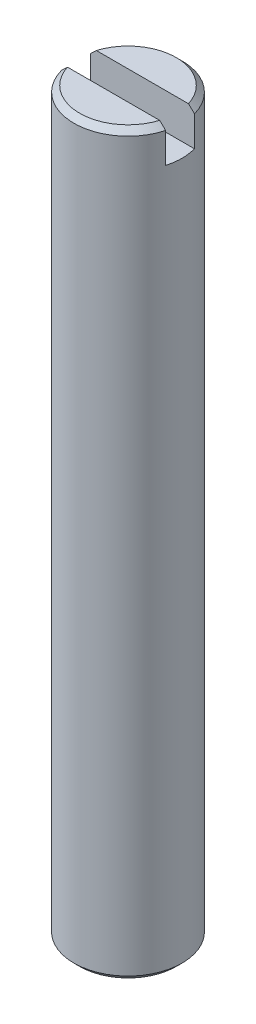
ISO-10303-21;
HEADER;
FILE_DESCRIPTION(('STEP AP214'),'2;1');
FILE_NAME('part.step','',(''),(''),'','','');
FILE_SCHEMA(('AUTOMOTIVE_DESIGN { 1 0 10303 214 1 1 1 1 }'));
ENDSEC;
DATA;
#1=APPLICATION_CONTEXT('core data for automotive mechanical design processes');
#2=APPLICATION_PROTOCOL_DEFINITION('international standard','automotive_design',2000,#1);
#3=PRODUCT_CONTEXT('',#1,'mechanical');
#4=PRODUCT('Part','Part','',(#3));
#5=PRODUCT_RELATED_PRODUCT_CATEGORY('part','',(#4));
#6=PRODUCT_DEFINITION_FORMATION('','',#4);
#7=PRODUCT_DEFINITION_CONTEXT('part definition',#1,'design');
#8=PRODUCT_DEFINITION('design','',#6,#7);
#9=PRODUCT_DEFINITION_SHAPE('','',#8);
#10=(LENGTH_UNIT() NAMED_UNIT(*) SI_UNIT(.MILLI.,.METRE.));
#11=(NAMED_UNIT(*) PLANE_ANGLE_UNIT() SI_UNIT($,.RADIAN.));
#12=(NAMED_UNIT(*) SI_UNIT($,.STERADIAN.) SOLID_ANGLE_UNIT());
#13=UNCERTAINTY_MEASURE_WITH_UNIT(LENGTH_MEASURE(1.E-05),#10,'distance_accuracy_value','');
#14=(GEOMETRIC_REPRESENTATION_CONTEXT(3) GLOBAL_UNCERTAINTY_ASSIGNED_CONTEXT((#13)) GLOBAL_UNIT_ASSIGNED_CONTEXT((#10,
#11,#12)) REPRESENTATION_CONTEXT('',''));
#15=CARTESIAN_POINT('',(0.,0.,0.));
#16=DIRECTION('',(0.,0.,1.));
#17=DIRECTION('',(1.,0.,0.));
#18=AXIS2_PLACEMENT_3D('',#15,#16,#17);
#19=CARTESIAN_POINT('',(0.,65.1002,0.));
#20=DIRECTION('',(0.,-1.,0.));
#21=DIRECTION('',(0.,0.,-0.999999999999981));
#22=AXIS2_PLACEMENT_3D('',#19,#20,#21);
#23=CYLINDRICAL_SURFACE('',#22,4.7625);
#24=CARTESIAN_POINT('',(0.,0.508000000000008,0.));
#25=DIRECTION('',(0.,1.,0.));
#26=DIRECTION('',(0.,0.,0.999999999999981));
#27=AXIS2_PLACEMENT_3D('',#24,#25,#26);
#28=CIRCLE('',#27,4.7625);
#29=CARTESIAN_POINT('',(0.,0.508000000000003,4.76249999999992));
#30=VERTEX_POINT('',#29);
#31=EDGE_CURVE('E163',#30,#30,#28,.T.);
#32=ORIENTED_EDGE('',*,*,#31,.T.);
#33=EDGE_LOOP('',(#32));
#34=FACE_BOUND('',#33,.T.);
#35=DIRECTION('',(0.,1.,0.));
#36=VECTOR('',#35,1.);
#37=CARTESIAN_POINT('',(4.59004950733374,61.9252000000007,-1.26998101175738));
#38=LINE('',#37,#36);
#39=CARTESIAN_POINT('',(4.59004950733374,61.9252000000007,-1.26998101175738));
#40=VERTEX_POINT('',#39);
#41=CARTESIAN_POINT('',(4.59004950733381,64.5922000000007,-1.26998101175736));
#42=VERTEX_POINT('',#41);
#43=EDGE_CURVE('E85',#40,#42,#38,.T.);
#44=ORIENTED_EDGE('',*,*,#43,.F.);
#45=CARTESIAN_POINT('',(-2.63677968348475E-13,61.9252000000004,1.38777878078145E-13));
#46=DIRECTION('',(0.,1.,0.));
#47=DIRECTION('',(0.,0.,0.999999999999981));
#48=AXIS2_PLACEMENT_3D('',#45,#46,#47);
#49=CIRCLE('',#48,4.7625);
#50=CARTESIAN_POINT('',(4.59003899978012,61.9252000000007,1.27001898824262));
#51=VERTEX_POINT('',#50);
#52=EDGE_CURVE('E124',#51,#40,#49,.T.);
#53=ORIENTED_EDGE('',*,*,#52,.F.);
#54=DIRECTION('',(0.,1.,0.));
#55=VECTOR('',#54,1.);
#56=CARTESIAN_POINT('',(4.59003899978012,61.9252000000007,1.27001898824262));
#57=LINE('',#56,#55);
#58=CARTESIAN_POINT('',(4.59003899978015,64.5922000000007,1.27001898824262));
#59=VERTEX_POINT('',#58);
#60=EDGE_CURVE('E154',#51,#59,#57,.T.);
#61=ORIENTED_EDGE('',*,*,#60,.T.);
#62=CARTESIAN_POINT('',(0.,64.5922,0.));
#63=DIRECTION('',(0.,1.,0.));
#64=DIRECTION('',(0.,0.,0.999999999999981));
#65=AXIS2_PLACEMENT_3D('',#62,#63,#64);
#66=CIRCLE('',#65,4.7625);
#67=CARTESIAN_POINT('',(-4.59003899978025,64.5922,1.27001898824262));
#68=VERTEX_POINT('',#67);
#69=EDGE_CURVE('E153',#59,#68,#66,.F.);
#70=ORIENTED_EDGE('',*,*,#69,.T.);
#71=DIRECTION('',(0.,1.,0.));
#72=VECTOR('',#71,1.);
#73=CARTESIAN_POINT('',(-4.59003899978025,61.9252,1.27001898824262));
#74=LINE('',#73,#72);
#75=CARTESIAN_POINT('',(-4.59003899978025,61.9252,1.27001898824262));
#76=VERTEX_POINT('',#75);
#77=EDGE_CURVE('E123',#76,#68,#74,.T.);
#78=ORIENTED_EDGE('',*,*,#77,.F.);
#79=CARTESIAN_POINT('',(-2.63677968348475E-13,61.9252000000004,1.38777878078145E-13));
#80=DIRECTION('',(0.,1.,0.));
#81=DIRECTION('',(0.,0.,0.999999999999981));
#82=AXIS2_PLACEMENT_3D('',#79,#80,#81);
#83=CIRCLE('',#82,4.7625);
#84=CARTESIAN_POINT('',(-4.59004950733394,61.9252,-1.26998101175735));
#85=VERTEX_POINT('',#84);
#86=EDGE_CURVE('E130',#85,#76,#83,.T.);
#87=ORIENTED_EDGE('',*,*,#86,.F.);
#88=DIRECTION('',(0.,1.,0.));
#89=VECTOR('',#88,1.);
#90=CARTESIAN_POINT('',(-4.59004950733394,61.9252,-1.26998101175735));
#91=LINE('',#90,#89);
#92=CARTESIAN_POINT('',(-4.59004950733387,64.5922,-1.26998101175736));
#93=VERTEX_POINT('',#92);
#94=EDGE_CURVE('E113',#85,#93,#91,.T.);
#95=ORIENTED_EDGE('',*,*,#94,.T.);
#96=EDGE_CURVE('E162',#93,#42,#66,.F.);
#97=ORIENTED_EDGE('',*,*,#96,.T.);
#98=EDGE_LOOP('',(#44,#53,#61,#70,#78,#87,#95,#97));
#99=FACE_BOUND('',#98,.T.);
#100=ADVANCED_FACE('F54',(#34,#99),#23,.T.);
#101=CARTESIAN_POINT('',(0.,65.1002,0.));
#102=DIRECTION('',(0.,1.,0.));
#103=DIRECTION('',(0.,0.,0.999999999999981));
#104=AXIS2_PLACEMENT_3D('',#101,#102,#103);
#105=PLANE('',#104);
#106=CARTESIAN_POINT('',(0.,65.1002,0.));
#107=DIRECTION('',(0.,1.,0.));
#108=DIRECTION('',(0.,0.,0.999999999999981));
#109=AXIS2_PLACEMENT_3D('',#106,#107,#108);
#110=CIRCLE('',#109,4.25450000000001);
#111=CARTESIAN_POINT('',(4.06053179765584,65.1002000000007,-1.26998101175729));
#112=VERTEX_POINT('',#111);
#113=CARTESIAN_POINT('',(-4.06053179765604,65.1002,-1.26998101175738));
#114=VERTEX_POINT('',#113);
#115=EDGE_CURVE('E174',#112,#114,#110,.T.);
#116=ORIENTED_EDGE('',*,*,#115,.T.);
#117=DIRECTION('',(0.999999999999984,0.,0.));
#118=VECTOR('',#117,1.);
#119=CARTESIAN_POINT('',(0.,65.1002,-1.26998101175732));
#120=LINE('',#119,#118);
#121=EDGE_CURVE('E145',#114,#112,#120,.T.);
#122=ORIENTED_EDGE('',*,*,#121,.T.);
#123=EDGE_LOOP('',(#116,#122));
#124=FACE_BOUND('',#123,.T.);
#125=ADVANCED_FACE('F196',(#124),#105,.T.);
#126=CARTESIAN_POINT('',(0.,65.1002,0.));
#127=DIRECTION('',(0.,-1.,0.));
#128=DIRECTION('',(0.,0.,-0.999999999999981));
#129=AXIS2_PLACEMENT_3D('',#126,#127,#128);
#130=CONICAL_SURFACE('',#129,4.25450000000001,0.785398163397447);
#131=ORIENTED_EDGE('',*,*,#96,.F.);
#132=CARTESIAN_POINT('',(-4.59074950733394,64.5915253433965,-1.26998101175736));
#133=CARTESIAN_POINT('',(-4.49426275570938,64.6845163030769,-1.26998101175731));
#134=CARTESIAN_POINT('',(-4.39767496238978,64.7774026086035,-1.26998101175729));
#135=CARTESIAN_POINT('',(-4.20424670417685,64.962913634492,-1.26998101175728));
#136=CARTESIAN_POINT('',(-4.10740623679045,65.0555383522538,-1.26998101175728));
#137=CARTESIAN_POINT('',(-3.81636135916374,65.3330070632296,-1.26998101175729));
#138=CARTESIAN_POINT('',(-3.62170447919837,65.517377031967,-1.26998101175729));
#139=CARTESIAN_POINT('',(-3.23385271365689,65.8810673162497,-1.26998101175728));
#140=CARTESIAN_POINT('',(-3.0406886465293,66.0604203291235,-1.26998101175728));
#141=CARTESIAN_POINT('',(-2.74874204893649,66.3270120387675,-1.26998101175729));
#142=CARTESIAN_POINT('',(-2.65106751309825,66.4154627993676,-1.26998101175729));
#143=CARTESIAN_POINT('',(-2.45472844235903,66.5912571798075,-1.26998101175728));
#144=CARTESIAN_POINT('',(-2.35606393247958,66.6786008275039,-1.26998101175726));
#145=CARTESIAN_POINT('',(-2.18558356670794,66.8271684177092,-1.26998101175727));
#146=CARTESIAN_POINT('',(-2.11409633993677,66.8887689772846,-1.26998101175728));
#147=CARTESIAN_POINT('',(-1.97023146497192,67.0109386523525,-1.2699810117573));
#148=CARTESIAN_POINT('',(-1.89785373001643,67.0715076659491,-1.2699810117573));
#149=CARTESIAN_POINT('',(-1.75124585860368,67.1918452507448,-1.26998101175728));
#150=CARTESIAN_POINT('',(-1.67700453882124,67.2516002471075,-1.26998101175727));
#151=CARTESIAN_POINT('',(-1.52700509754219,67.3691465721649,-1.26998101175731));
#152=CARTESIAN_POINT('',(-1.45124736932053,67.4269383997769,-1.26998101175736));
#153=CARTESIAN_POINT('',(-1.29660057146003,67.5405269941732,-1.26998101175736));
#154=CARTESIAN_POINT('',(-1.2176825590367,67.5962846720251,-1.26998101175731));
#155=CARTESIAN_POINT('',(-1.0568329975531,67.7035951186852,-1.26998101175727));
#156=CARTESIAN_POINT('',(-0.974897496831777,67.7551420669048,-1.2699810117573));
#157=CARTESIAN_POINT('',(-0.808051933647524,67.8509829353184,-1.26998101175729));
#158=CARTESIAN_POINT('',(-0.723186008936165,67.8953523119665,-1.26998101175726));
#159=CARTESIAN_POINT('',(-0.548714807410018,67.9734248014219,-1.26998101175733));
#160=CARTESIAN_POINT('',(-0.459126204350625,68.007162844366,-1.26998101175743));
#161=CARTESIAN_POINT('',(-0.324917691979478,68.0444440580088,-1.26998101175736));
#162=CARTESIAN_POINT('',(-0.282098758259119,68.0544592501056,-1.26998101175731));
#163=CARTESIAN_POINT('',(-0.195697393467257,68.0704299175541,-1.26998101175727));
#164=CARTESIAN_POINT('',(-0.152115050118602,68.0763858562532,-1.26998101175729));
#165=CARTESIAN_POINT('',(-0.0647426939826841,68.0838114605327,-1.2699810117573));
#166=CARTESIAN_POINT('',(-0.0209542627054029,68.08529939965,-1.2699810117573));
#167=CARTESIAN_POINT('',(0.0665421596847269,68.0837294980874,-1.26998101175729));
#168=CARTESIAN_POINT('',(0.110250145968702,68.0806713928947,-1.26998101175729));
#169=CARTESIAN_POINT('',(0.196822341365673,68.0702719382411,-1.26998101175729));
#170=CARTESIAN_POINT('',(0.239690363574121,68.0629616620645,-1.26998101175729));
#171=CARTESIAN_POINT('',(0.32460713407298,68.0445469596036,-1.2699810117573));
#172=CARTESIAN_POINT('',(0.366655539388717,68.0334409795395,-1.2699810117573));
#173=CARTESIAN_POINT('',(0.45001897542273,68.0079327360431,-1.26998101175729));
#174=CARTESIAN_POINT('',(0.491327637359782,67.9935099483332,-1.26998101175728));
#175=CARTESIAN_POINT('',(0.572888863071271,67.9619903012736,-1.26998101175731));
#176=CARTESIAN_POINT('',(0.61314162336338,67.9448939436945,-1.26998101175736));
#177=CARTESIAN_POINT('',(0.728288887841829,67.8922556541554,-1.26998101175741));
#178=CARTESIAN_POINT('',(0.801899264997753,67.853914178528,-1.26998101175733));
#179=CARTESIAN_POINT('',(0.946227515108531,67.7720860231769,-1.26998101175727));
#180=CARTESIAN_POINT('',(1.01694189197514,67.7285933577535,-1.26998101175729));
#181=CARTESIAN_POINT('',(1.15635730274571,67.6379580862929,-1.26998101175731));
#182=CARTESIAN_POINT('',(1.22504958681348,67.5908021371157,-1.2699810117573));
#183=CARTESIAN_POINT('',(1.36064282747446,67.4940686056052,-1.2699810117573));
#184=CARTESIAN_POINT('',(1.42754459779617,67.4444921532688,-1.2699810117573));
#185=CARTESIAN_POINT('',(1.5608390760659,67.3429384694286,-1.2699810117573));
#186=CARTESIAN_POINT('',(1.62721459021712,67.2909387762693,-1.2699810117573));
#187=CARTESIAN_POINT('',(1.75889415089429,67.1855970057394,-1.2699810117573));
#188=CARTESIAN_POINT('',(1.8241981278087,67.1322548417223,-1.2699810117573));
#189=CARTESIAN_POINT('',(2.01855524523048,66.9709736529516,-1.2699810117573));
#190=CARTESIAN_POINT('',(2.14636437889695,66.8615378462329,-1.26998101175731));
#191=CARTESIAN_POINT('',(2.37451403941741,66.6623463589025,-1.26998101175731));
#192=CARTESIAN_POINT('',(2.47524009909021,66.5730278303459,-1.26998101175731));
#193=CARTESIAN_POINT('',(2.67567950488401,66.39325630394,-1.2699810117573));
#194=CARTESIAN_POINT('',(2.77539282434622,66.3028032763662,-1.2699810117573));
#195=CARTESIAN_POINT('',(3.0735865197818,66.0300544952168,-1.26998101175731));
#196=CARTESIAN_POINT('',(3.27093990444587,65.8465289583345,-1.26998101175731));
#197=CARTESIAN_POINT('',(3.65602924308663,65.4849109229384,-1.26998101175731));
#198=CARTESIAN_POINT('',(3.8438354054998,65.3068928254433,-1.26998101175731));
#199=CARTESIAN_POINT('',(4.1246114882073,65.039090062743,-1.26998101175731));
#200=CARTESIAN_POINT('',(4.2179978835399,64.949741593544,-1.26998101175731));
#201=CARTESIAN_POINT('',(4.40453737700997,64.770803006567,-1.26998101175731));
#202=CARTESIAN_POINT('',(4.49769047713895,64.6812128908655,-1.2699810117573));
#203=CARTESIAN_POINT('',(4.59074950733379,64.5915253433972,-1.26998101175729));
#204=B_SPLINE_CURVE_WITH_KNOTS('',3,(#132,#133,#134,#135,#136,#137,#138,#139,#140,#141,#142,
#143,#144,#145,#146,#147,#148,#149,#150,#151,#152,#153,#154,#155,#156,#157,#158,#159,#160,#161,
#162,#163,#164,#165,#166,#167,#168,#169,#170,#171,#172,#173,#174,#175,#176,#177,#178,#179,#180,
#181,#182,#183,#184,#185,#186,#187,#188,#189,#190,#191,#192,#193,#194,#195,#196,#197,#198,#199,
#200,#201,#202,#203),.UNSPECIFIED.,.F.,.F.,(4,2,2,2,2,2,2,2,2,2,2,2,2,2,2,2,2,2,2,2,2,2,2,2,2,2,
2,2,2,2,2,2,2,2,2,4),(0.,0.402011401713599,0.804026785108336,1.60835370186284,2.39909846986459,
2.79440885596589,3.18970927566334,3.47280178927791,3.75592210639236,4.04180465812567,
4.32761400402758,4.61741129342275,4.90760262616238,5.19451101810427,5.48046667506966,
5.61222725798859,5.74397279844561,5.87517877786248,6.00639239183212,6.13665898169748,
6.26697896047333,6.39812815217902,6.52925275952069,6.77789148363919,7.02682201495168,
7.27670608957075,7.52647460246064,7.77940817061136,8.03235810584316,8.53707669958208,
8.94094077858872,9.34481546127225,10.1532886747437,10.929591338277,11.3173247422461,
11.705054825),.UNSPECIFIED.);
#205=EDGE_CURVE('E13',#93,#114,#204,.T.);
#206=ORIENTED_EDGE('',*,*,#205,.T.);
#207=ORIENTED_EDGE('',*,*,#115,.F.);
#208=EDGE_CURVE('E60',#112,#42,#204,.T.);
#209=ORIENTED_EDGE('',*,*,#208,.T.);
#210=EDGE_LOOP('',(#131,#206,#207,#209));
#211=FACE_BOUND('',#210,.T.);
#212=ADVANCED_FACE('F194',(#211),#130,.T.);
#213=DIRECTION('',(0.999999999999983,0.,0.));
#214=VECTOR('',#213,1.);
#215=CARTESIAN_POINT('',(0.,65.1002,1.27001898824267));
#216=LINE('',#215,#214);
#217=CARTESIAN_POINT('',(-4.06051991985058,65.1002,1.27001898824262));
#218=VERTEX_POINT('',#217);
#219=CARTESIAN_POINT('',(4.06051991985053,65.1002000000007,1.27001898824262));
#220=VERTEX_POINT('',#219);
#221=EDGE_CURVE('E77',#218,#220,#216,.T.);
#222=ORIENTED_EDGE('',*,*,#221,.F.);
#223=EDGE_CURVE('E171',#218,#220,#110,.T.);
#224=ORIENTED_EDGE('',*,*,#223,.T.);
#225=EDGE_LOOP('',(#222,#224));
#226=FACE_BOUND('',#225,.T.);
#227=ADVANCED_FACE('F190',(#226),#105,.T.);
#228=CARTESIAN_POINT('',(0.,0.,0.));
#229=DIRECTION('',(0.,1.,0.));
#230=DIRECTION('',(0.,0.,0.999999999999981));
#231=AXIS2_PLACEMENT_3D('',#228,#229,#230);
#232=PLANE('',#231);
#233=CARTESIAN_POINT('',(0.,0.,0.));
#234=DIRECTION('',(0.,1.,0.));
#235=DIRECTION('',(0.,0.,0.999999999999981));
#236=AXIS2_PLACEMENT_3D('',#233,#234,#235);
#237=CIRCLE('',#236,4.2545);
#238=CARTESIAN_POINT('',(0.,0.,4.25449999999992));
#239=VERTEX_POINT('',#238);
#240=EDGE_CURVE('E167',#239,#239,#237,.F.);
#241=ORIENTED_EDGE('',*,*,#240,.T.);
#242=EDGE_LOOP('',(#241));
#243=FACE_BOUND('',#242,.T.);
#244=ADVANCED_FACE('F193',(#243),#232,.F.);
#245=CARTESIAN_POINT('',(0.,0.508000000000008,0.));
#246=DIRECTION('',(0.,1.,0.));
#247=DIRECTION('',(0.,0.,0.999999999999981));
#248=AXIS2_PLACEMENT_3D('',#245,#246,#247);
#249=CONICAL_SURFACE('',#248,4.7625,0.78539816339744);
#250=ORIENTED_EDGE('',*,*,#240,.F.);
#251=EDGE_LOOP('',(#250));
#252=FACE_BOUND('',#251,.T.);
#253=ORIENTED_EDGE('',*,*,#31,.F.);
#254=EDGE_LOOP('',(#253));
#255=FACE_BOUND('',#254,.T.);
#256=ADVANCED_FACE('F199',(#252,#255),#249,.T.);
#257=CARTESIAN_POINT('',(-4.59073899978027,64.5915253449406,1.27001898824269));
#258=CARTESIAN_POINT('',(-4.49425668428542,64.6845118167069,1.27001898824271));
#259=CARTESIAN_POINT('',(-4.39767333001825,64.7773936370717,1.27001898824272));
#260=CARTESIAN_POINT('',(-4.20425396055334,64.9628957027796,1.27001898824272));
#261=CARTESIAN_POINT('',(-4.10741794286295,65.0555159455231,1.27001898824272));
#262=CARTESIAN_POINT('',(-3.81638645235925,65.3329712392876,1.27001898824272));
#263=CARTESIAN_POINT('',(-3.62173853257117,65.5173322886024,1.27001898824272));
#264=CARTESIAN_POINT('',(-3.23390437611167,65.8810052954539,1.27001898824271));
#265=CARTESIAN_POINT('',(-3.04074895293064,66.0603499451458,1.27001898824269));
#266=CARTESIAN_POINT('',(-2.74881554810319,66.3269293617852,1.27001898824273));
#267=CARTESIAN_POINT('',(-2.65114544606304,66.4153760680828,1.27001898824275));
#268=CARTESIAN_POINT('',(-2.45481536701483,66.5911624793716,1.27001898824268));
#269=CARTESIAN_POINT('',(-2.35615541501878,66.6785022122088,1.27001898824259));
#270=CARTESIAN_POINT('',(-2.18567688465805,66.8270686578986,1.27001898824262));
#271=CARTESIAN_POINT('',(-2.11418682586514,66.8886718610933,1.27001898824269));
#272=CARTESIAN_POINT('',(-1.97031626787743,67.0108468052915,1.27001898824274));
#273=CARTESIAN_POINT('',(-1.89793568191948,67.0714184443978,1.27001898824271));
#274=CARTESIAN_POINT('',(-1.75132208302257,67.191761257935,1.27001898824271));
#275=CARTESIAN_POINT('',(-1.67707788694937,67.2515188578194,1.27001898824273));
#276=CARTESIAN_POINT('',(-1.52707265969066,67.369070355535,1.2700189882427));
#277=CARTESIAN_POINT('',(-1.45131202179685,67.426864752302,1.27001898824265));
#278=CARTESIAN_POINT('',(-1.29665935166496,67.5404584445371,1.27001898824264));
#279=CARTESIAN_POINT('',(-1.21773837696825,67.5962186517739,1.27001898824269));
#280=CARTESIAN_POINT('',(-1.05688281207054,67.7035340885964,1.27001898824273));
#281=CARTESIAN_POINT('',(-0.974944270108379,67.7550834974983,1.27001898824271));
#282=CARTESIAN_POINT('',(-0.808092500141377,67.8509291587475,1.27001898824271));
#283=CARTESIAN_POINT('',(-0.723223409428834,67.8953008658459,1.27001898824273));
#284=CARTESIAN_POINT('',(-0.548745673024659,67.9733777671185,1.27001898824269));
#285=CARTESIAN_POINT('',(-0.459153701591877,68.0071178918299,1.27001898824265));
#286=CARTESIAN_POINT('',(-0.324940179815496,68.0444017125949,1.27001898824268));
#287=CARTESIAN_POINT('',(-0.282119728223686,68.0544176549883,1.2700189882427));
#288=CARTESIAN_POINT('',(-0.195715264960915,68.0703896881926,1.27001898824272));
#289=CARTESIAN_POINT('',(-0.152131341027969,68.0763462424084,1.27001898824271));
#290=CARTESIAN_POINT('',(-0.0647557921807778,68.0837728965329,1.27001898824271));
#291=CARTESIAN_POINT('',(-0.0209657491644753,68.0852612725354,1.27001898824271));
#292=CARTESIAN_POINT('',(0.0665339310270709,68.0836920381696,1.2700189882427));
#293=CARTESIAN_POINT('',(0.110243563376402,68.080634163328,1.27001898824269));
#294=CARTESIAN_POINT('',(0.196819071124079,68.0702349463792,1.27001898824269));
#295=CARTESIAN_POINT('',(0.239688759254831,68.0629246764828,1.2700189882427));
#296=CARTESIAN_POINT('',(0.324608839857158,68.0445097779648,1.27001898824271));
#297=CARTESIAN_POINT('',(0.366658889338607,68.0334035954502,1.27001898824271));
#298=CARTESIAN_POINT('',(0.450025596540305,68.0078947607305,1.27001898824271));
#299=CARTESIAN_POINT('',(0.491335884910059,67.9934715820917,1.27001898824271));
#300=CARTESIAN_POINT('',(0.572900314317341,67.9619510025572,1.2700189882427));
#301=CARTESIAN_POINT('',(0.613154651874113,67.9448541034408,1.27001898824269));
#302=CARTESIAN_POINT('',(0.728304674813887,67.8922148676973,1.27001898824267));
#303=CARTESIAN_POINT('',(0.801916251635408,67.8538730115876,1.2700189882427));
#304=CARTESIAN_POINT('',(0.946246874957468,67.7720440169869,1.27001898824271));
#305=CARTESIAN_POINT('',(1.0169624254079,67.728550892821,1.27001898824271));
#306=CARTESIAN_POINT('',(1.15638015235086,67.6379146358415,1.2700189882427));
#307=CARTESIAN_POINT('',(1.22507357899877,67.5907581597995,1.2700189882427));
#308=CARTESIAN_POINT('',(1.36066907361056,67.4940235179242,1.2700189882427));
#309=CARTESIAN_POINT('',(1.42757195529849,67.4444464820876,1.2700189882427));
#310=CARTESIAN_POINT('',(1.56086862165724,67.3428915936969,1.2700189882427));
#311=CARTESIAN_POINT('',(1.62724521258197,67.290891279452,1.2700189882427));
#312=CARTESIAN_POINT('',(1.7589269020232,67.1855482302833,1.2700189882427));
#313=CARTESIAN_POINT('',(1.82423193092549,67.1322054087093,1.2700189882427));
#314=CARTESIAN_POINT('',(2.01859217224867,66.9709222029889,1.2700189882427));
#315=CARTESIAN_POINT('',(2.14640334616573,66.8614849933623,1.27001898824269));
#316=CARTESIAN_POINT('',(2.37455267283534,66.6622943598353,1.27001898824269));
#317=CARTESIAN_POINT('',(2.47527642314467,66.5729781625041,1.27001898824269));
#318=CARTESIAN_POINT('',(2.67571124540382,66.3932113343851,1.2700189882427));
#319=CARTESIAN_POINT('',(2.77542229069807,66.3027606738762,1.2700189882427));
#320=CARTESIAN_POINT('',(3.07360917977803,66.0300190277183,1.27001898824269));
#321=CARTESIAN_POINT('',(3.27095805842265,65.846498283142,1.27001898824269));
#322=CARTESIAN_POINT('',(3.65603886784974,65.4848893692352,1.27001898824269));
#323=CARTESIAN_POINT('',(3.84384100411015,65.3068755980258,1.27001898824269));
#324=CARTESIAN_POINT('',(4.12461104627103,65.0390793103724,1.27001898824269));
#325=CARTESIAN_POINT('',(4.21799543048875,64.9497329944853,1.27001898824269));
#326=CARTESIAN_POINT('',(4.40453089894888,64.7707987105833,1.27001898824269));
#327=CARTESIAN_POINT('',(4.4976819851828,64.6812107446449,1.2700189882427));
#328=CARTESIAN_POINT('',(4.59073899978003,64.5915253449414,1.27001898824272));
#329=B_SPLINE_CURVE_WITH_KNOTS('',3,(#257,#258,#259,#260,#261,#262,#263,#264,#265,#266,#267,
#268,#269,#270,#271,#272,#273,#274,#275,#276,#277,#278,#279,#280,#281,#282,#283,#284,#285,#286,
#287,#288,#289,#290,#291,#292,#293,#294,#295,#296,#297,#298,#299,#300,#301,#302,#303,#304,#305,
#306,#307,#308,#309,#310,#311,#312,#313,#314,#315,#316,#317,#318,#319,#320,#321,#322,#323,#324,
#325,#326,#327,#328),.UNSPECIFIED.,.F.,.F.,(4,2,2,2,2,2,2,2,2,2,2,2,2,2,2,2,2,2,2,2,2,2,2,2,2,2,
2,2,2,2,2,2,2,2,2,4),(0.,0.40199247615765,0.803988933285025,1.60827793341504,2.39898663019326,
2.794278993444,3.18956139328765,3.47266552016085,3.75579745150743,4.04169162260539,
4.32751258341885,4.61732150988848,4.90752449535174,5.19444454370042,5.48041182946419,
5.61217735436864,5.74392783488664,5.87513867994325,6.00635715834926,6.13662865852905,
6.26695355058642,6.39810772726302,6.52923731959761,6.77787976202492,7.02681401029608,
7.27670180368777,7.52647403632442,7.77941129565737,8.03236492255707,8.53709090010903,
8.94094515612906,9.34481001465624,10.1532635385877,10.9295485069459,11.31727308564,
11.7049943432242),.UNSPECIFIED.);
#330=EDGE_CURVE('E182',#68,#218,#329,.T.);
#331=ORIENTED_EDGE('',*,*,#330,.F.);
#332=ORIENTED_EDGE('',*,*,#69,.F.);
#333=EDGE_CURVE('E175',#220,#59,#329,.T.);
#334=ORIENTED_EDGE('',*,*,#333,.F.);
#335=ORIENTED_EDGE('',*,*,#223,.F.);
#336=EDGE_LOOP('',(#331,#332,#334,#335));
#337=FACE_BOUND('',#336,.T.);
#338=ADVANCED_FACE('F57',(#337),#130,.T.);
#339=CARTESIAN_POINT('',(-1.38777878078145E-13,61.9252000000004,-1.2699810117573));
#340=DIRECTION('',(0.,0.,0.99999999999998));
#341=DIRECTION('',(0.999999999999984,0.,0.));
#342=AXIS2_PLACEMENT_3D('',#339,#340,#341);
#343=PLANE('',#342);
#344=ORIENTED_EDGE('',*,*,#94,.F.);
#345=DIRECTION('',(0.999999999999984,0.,0.));
#346=VECTOR('',#345,1.);
#347=CARTESIAN_POINT('',(-1.38777878078145E-13,61.9252000000004,-1.2699810117573));
#348=LINE('',#347,#346);
#349=EDGE_CURVE('E116',#85,#40,#348,.T.);
#350=ORIENTED_EDGE('',*,*,#349,.T.);
#351=ORIENTED_EDGE('',*,*,#43,.T.);
#352=ORIENTED_EDGE('',*,*,#208,.F.);
#353=ORIENTED_EDGE('',*,*,#121,.F.);
#354=ORIENTED_EDGE('',*,*,#205,.F.);
#355=EDGE_LOOP('',(#344,#350,#351,#352,#353,#354));
#356=FACE_BOUND('',#355,.T.);
#357=ADVANCED_FACE('F115',(#356),#343,.T.);
#358=CARTESIAN_POINT('',(-1.94289029309402E-13,61.9252000000004,1.2700189882427));
#359=DIRECTION('',(0.,0.,0.99999999999998));
#360=DIRECTION('',(0.999999999999983,0.,0.));
#361=AXIS2_PLACEMENT_3D('',#358,#359,#360);
#362=PLANE('',#361);
#363=ORIENTED_EDGE('',*,*,#330,.T.);
#364=ORIENTED_EDGE('',*,*,#221,.T.);
#365=ORIENTED_EDGE('',*,*,#333,.T.);
#366=ORIENTED_EDGE('',*,*,#60,.F.);
#367=DIRECTION('',(0.999999999999983,0.,0.));
#368=VECTOR('',#367,1.);
#369=CARTESIAN_POINT('',(-1.94289029309402E-13,61.9252000000004,1.2700189882427));
#370=LINE('',#369,#368);
#371=EDGE_CURVE('E137',#76,#51,#370,.T.);
#372=ORIENTED_EDGE('',*,*,#371,.F.);
#373=ORIENTED_EDGE('',*,*,#77,.T.);
#374=EDGE_LOOP('',(#363,#364,#365,#366,#372,#373));
#375=FACE_BOUND('',#374,.T.);
#376=ADVANCED_FACE('F183',(#375),#362,.F.);
#377=CARTESIAN_POINT('',(-2.63677968348475E-13,61.9252000000004,1.38777878078145E-13));
#378=DIRECTION('',(0.,1.,0.));
#379=DIRECTION('',(0.,0.,0.999999999999981));
#380=AXIS2_PLACEMENT_3D('',#377,#378,#379);
#381=PLANE('',#380);
#382=ORIENTED_EDGE('',*,*,#349,.F.);
#383=ORIENTED_EDGE('',*,*,#86,.T.);
#384=ORIENTED_EDGE('',*,*,#371,.T.);
#385=ORIENTED_EDGE('',*,*,#52,.T.);
#386=EDGE_LOOP('',(#382,#383,#384,#385));
#387=FACE_BOUND('',#386,.T.);
#388=ADVANCED_FACE('F128',(#387),#381,.T.);
#389=CLOSED_SHELL('',(#100,#125,#212,#227,#244,#256,#338,#357,#376,#388));
#390=MANIFOLD_SOLID_BREP('B2',#389);
#391=ADVANCED_BREP_SHAPE_REPRESENTATION('',(#18,#390),#14);
#392=SHAPE_DEFINITION_REPRESENTATION(#9,#391);
ENDSEC;
END-ISO-10303-21;
